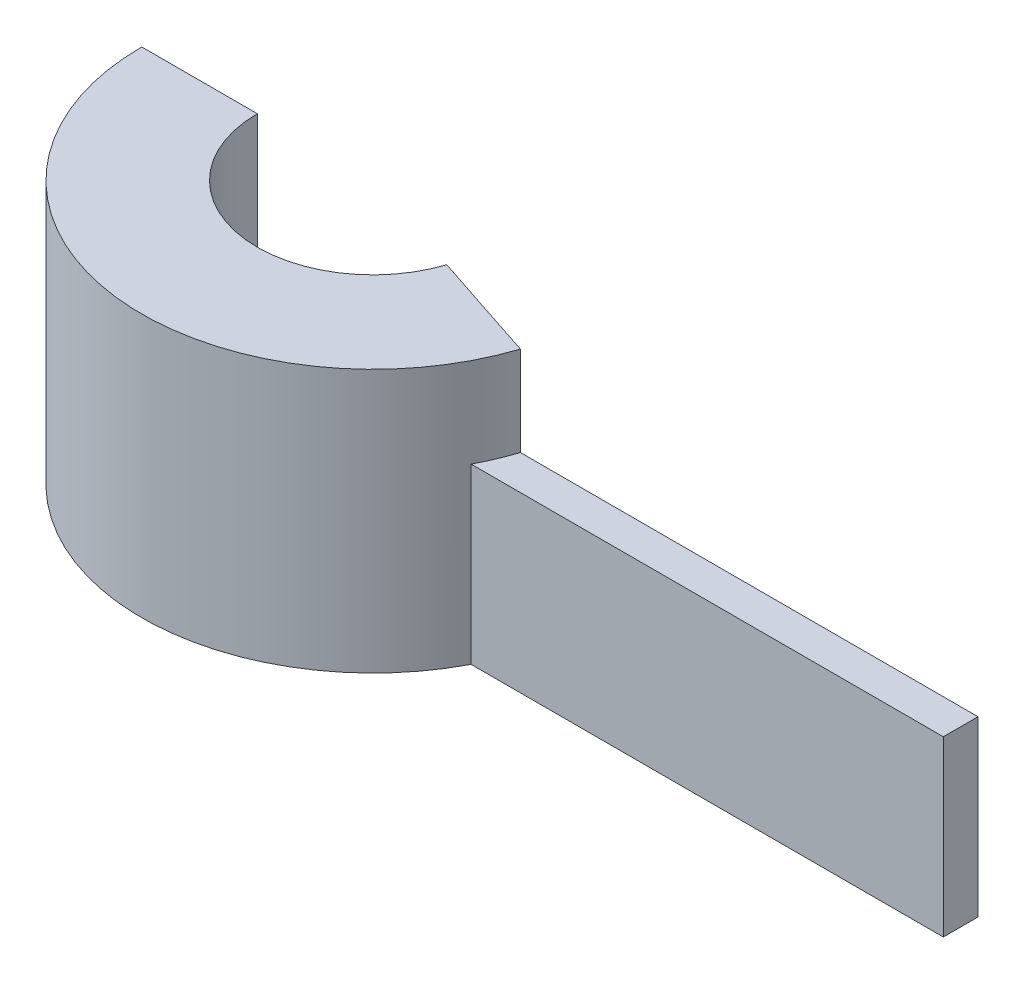
ISO-10303-21;
HEADER;
FILE_DESCRIPTION(('STEP AP214'),'2;1');
FILE_NAME('part.step','',(''),(''),'','','');
FILE_SCHEMA(('AUTOMOTIVE_DESIGN { 1 0 10303 214 1 1 1 1 }'));
ENDSEC;
DATA;
#1=APPLICATION_CONTEXT('core data for automotive mechanical design processes');
#2=APPLICATION_PROTOCOL_DEFINITION('international standard','automotive_design',2000,#1);
#3=PRODUCT_CONTEXT('',#1,'mechanical');
#4=PRODUCT('Part','Part','',(#3));
#5=PRODUCT_RELATED_PRODUCT_CATEGORY('part','',(#4));
#6=PRODUCT_DEFINITION_FORMATION('','',#4);
#7=PRODUCT_DEFINITION_CONTEXT('part definition',#1,'design');
#8=PRODUCT_DEFINITION('design','',#6,#7);
#9=PRODUCT_DEFINITION_SHAPE('','',#8);
#10=(LENGTH_UNIT() NAMED_UNIT(*) SI_UNIT(.MILLI.,.METRE.));
#11=(NAMED_UNIT(*) PLANE_ANGLE_UNIT() SI_UNIT($,.RADIAN.));
#12=(NAMED_UNIT(*) SI_UNIT($,.STERADIAN.) SOLID_ANGLE_UNIT());
#13=UNCERTAINTY_MEASURE_WITH_UNIT(LENGTH_MEASURE(1.E-05),#10,'distance_accuracy_value','');
#14=(GEOMETRIC_REPRESENTATION_CONTEXT(3) GLOBAL_UNCERTAINTY_ASSIGNED_CONTEXT((#13)) GLOBAL_UNIT_ASSIGNED_CONTEXT((#10,
#11,#12)) REPRESENTATION_CONTEXT('',''));
#15=CARTESIAN_POINT('',(0.,0.,0.));
#16=DIRECTION('',(0.,0.,1.));
#17=DIRECTION('',(1.,0.,0.));
#18=AXIS2_PLACEMENT_3D('',#15,#16,#17);
#19=CARTESIAN_POINT('',(0.,2.5,0.));
#20=DIRECTION('',(0.,1.,0.));
#21=DIRECTION('',(-1.,0.,0.));
#22=AXIS2_PLACEMENT_3D('',#19,#20,#21);
#23=CYLINDRICAL_SURFACE('',#22,20.);
#24=DIRECTION('',(0.,-1.,0.));
#25=VECTOR('',#24,1.);
#26=CARTESIAN_POINT('',(18.9983551919633,0.,6.25));
#27=LINE('',#26,#25);
#28=CARTESIAN_POINT('',(18.9983551919633,16.75,6.25));
#29=VERTEX_POINT('',#28);
#30=CARTESIAN_POINT('',(18.9983551919633,9.,6.25));
#31=VERTEX_POINT('',#30);
#32=EDGE_CURVE('E112',#29,#31,#27,.T.);
#33=ORIENTED_EDGE('',*,*,#32,.F.);
#34=CARTESIAN_POINT('',(0.,16.75,0.));
#35=DIRECTION('',(0.,1.,0.));
#36=DIRECTION('',(-1.,0.,0.));
#37=AXIS2_PLACEMENT_3D('',#34,#35,#36);
#38=CIRCLE('',#37,20.);
#39=CARTESIAN_POINT('',(-20.,16.75,-1.39659253553725E-13));
#40=VERTEX_POINT('',#39);
#41=EDGE_CURVE('E163',#40,#29,#38,.T.);
#42=ORIENTED_EDGE('',*,*,#41,.F.);
#43=DIRECTION('',(0.,-1.,0.));
#44=VECTOR('',#43,1.);
#45=CARTESIAN_POINT('',(-20.,0.,-1.39659253553725E-13));
#46=LINE('',#45,#44);
#47=CARTESIAN_POINT('',(-20.,-6.00000000000001,-1.39659253553725E-13));
#48=VERTEX_POINT('',#47);
#49=EDGE_CURVE('E146',#40,#48,#46,.T.);
#50=ORIENTED_EDGE('',*,*,#49,.T.);
#51=CARTESIAN_POINT('',(0.,-6.00000000000001,0.));
#52=DIRECTION('',(0.,1.,0.));
#53=DIRECTION('',(-1.,0.,0.));
#54=AXIS2_PLACEMENT_3D('',#51,#52,#53);
#55=CIRCLE('',#54,20.);
#56=CARTESIAN_POINT('',(17.7323856263053,-6.00000000000001,9.25));
#57=VERTEX_POINT('',#56);
#58=EDGE_CURVE('E59',#48,#57,#55,.T.);
#59=ORIENTED_EDGE('',*,*,#58,.T.);
#60=DIRECTION('',(0.,1.,0.));
#61=VECTOR('',#60,1.);
#62=CARTESIAN_POINT('',(17.7323856263053,2.5,9.25));
#63=LINE('',#62,#61);
#64=CARTESIAN_POINT('',(17.7323856263053,9.,9.25));
#65=VERTEX_POINT('',#64);
#66=EDGE_CURVE('E12',#57,#65,#63,.T.);
#67=ORIENTED_EDGE('',*,*,#66,.T.);
#68=CARTESIAN_POINT('',(0.,9.,0.));
#69=DIRECTION('',(0.,-1.,0.));
#70=DIRECTION('',(0.,0.,-1.));
#71=AXIS2_PLACEMENT_3D('',#68,#69,#70);
#72=CIRCLE('',#71,20.);
#73=EDGE_CURVE('E49',#65,#31,#72,.F.);
#74=ORIENTED_EDGE('',*,*,#73,.T.);
#75=EDGE_LOOP('',(#33,#42,#50,#59,#67,#74));
#76=FACE_BOUND('',#75,.T.);
#77=ADVANCED_FACE('F42',(#76),#23,.T.);
#78=CARTESIAN_POINT('',(0.,-6.00000000000001,0.));
#79=DIRECTION('',(0.,1.,0.));
#80=DIRECTION('',(-1.,0.,0.));
#81=AXIS2_PLACEMENT_3D('',#78,#79,#80);
#82=PLANE('',#81);
#83=DIRECTION('',(-1.,0.,0.));
#84=VECTOR('',#83,1.);
#85=CARTESIAN_POINT('',(0.,-6.00000000000001,0.));
#86=LINE('',#85,#84);
#87=CARTESIAN_POINT('',(0.,-6.00000000000001,0.));
#88=VERTEX_POINT('',#87);
#89=EDGE_CURVE('E123',#88,#48,#86,.T.);
#90=ORIENTED_EDGE('',*,*,#89,.F.);
#91=DIRECTION('',(0.949917759598166,0.,0.3125));
#92=VECTOR('',#91,1.);
#93=CARTESIAN_POINT('',(0.,-6.00000000000001,0.));
#94=LINE('',#93,#92);
#95=CARTESIAN_POINT('',(18.9983551919633,-6.00000000000001,6.25));
#96=VERTEX_POINT('',#95);
#97=EDGE_CURVE('E109',#88,#96,#94,.T.);
#98=ORIENTED_EDGE('',*,*,#97,.T.);
#99=DIRECTION('',(-1.,0.,0.));
#100=VECTOR('',#99,1.);
#101=CARTESIAN_POINT('',(0.,-6.00000000000001,6.25));
#102=LINE('',#101,#100);
#103=CARTESIAN_POINT('',(58.5667702402718,-6.00000000000001,6.25));
#104=VERTEX_POINT('',#103);
#105=EDGE_CURVE('E122',#104,#96,#102,.T.);
#106=ORIENTED_EDGE('',*,*,#105,.F.);
#107=DIRECTION('',(0.,0.,-1.));
#108=VECTOR('',#107,1.);
#109=CARTESIAN_POINT('',(58.5667702402718,-6.00000000000001,9.25));
#110=LINE('',#109,#108);
#111=CARTESIAN_POINT('',(58.5667702402718,-6.00000000000001,9.25));
#112=VERTEX_POINT('',#111);
#113=EDGE_CURVE('E140',#112,#104,#110,.T.);
#114=ORIENTED_EDGE('',*,*,#113,.F.);
#115=DIRECTION('',(-1.,0.,0.));
#116=VECTOR('',#115,1.);
#117=CARTESIAN_POINT('',(0.,-6.00000000000001,9.25));
#118=LINE('',#117,#116);
#119=EDGE_CURVE('E139',#112,#57,#118,.T.);
#120=ORIENTED_EDGE('',*,*,#119,.T.);
#121=ORIENTED_EDGE('',*,*,#58,.F.);
#122=EDGE_LOOP('',(#90,#98,#106,#114,#120,#121));
#123=FACE_BOUND('',#122,.T.);
#124=ADVANCED_FACE('F121',(#123),#82,.F.);
#125=CARTESIAN_POINT('',(0.,16.75,0.));
#126=DIRECTION('',(0.,-1.,0.));
#127=DIRECTION('',(1.,0.,0.));
#128=AXIS2_PLACEMENT_3D('',#125,#126,#127);
#129=PLANE('',#128);
#130=ORIENTED_EDGE('',*,*,#41,.T.);
#131=DIRECTION('',(-0.949917759598166,0.,-0.3125));
#132=VECTOR('',#131,1.);
#133=CARTESIAN_POINT('',(0.,16.75,0.));
#134=LINE('',#133,#132);
#135=CARTESIAN_POINT('',(9.49917759598166,16.75,3.125));
#136=VERTEX_POINT('',#135);
#137=EDGE_CURVE('E184',#29,#136,#134,.T.);
#138=ORIENTED_EDGE('',*,*,#137,.T.);
#139=CARTESIAN_POINT('',(0.,16.75,0.));
#140=DIRECTION('',(0.,1.,0.));
#141=DIRECTION('',(-1.,0.,0.));
#142=AXIS2_PLACEMENT_3D('',#139,#140,#141);
#143=CIRCLE('',#142,10.);
#144=CARTESIAN_POINT('',(-10.,16.75,0.));
#145=VERTEX_POINT('',#144);
#146=EDGE_CURVE('E160',#145,#136,#143,.T.);
#147=ORIENTED_EDGE('',*,*,#146,.F.);
#148=DIRECTION('',(1.,0.,0.));
#149=VECTOR('',#148,1.);
#150=CARTESIAN_POINT('',(0.,16.75,0.));
#151=LINE('',#150,#149);
#152=EDGE_CURVE('E148',#40,#145,#151,.T.);
#153=ORIENTED_EDGE('',*,*,#152,.F.);
#154=EDGE_LOOP('',(#130,#138,#147,#153));
#155=FACE_BOUND('',#154,.T.);
#156=ADVANCED_FACE('F188',(#155),#129,.F.);
#157=CARTESIAN_POINT('',(0.,2.5,0.));
#158=DIRECTION('',(0.,1.,0.));
#159=DIRECTION('',(-1.,0.,0.));
#160=AXIS2_PLACEMENT_3D('',#157,#158,#159);
#161=CYLINDRICAL_SURFACE('',#160,10.);
#162=ORIENTED_EDGE('',*,*,#146,.T.);
#163=DIRECTION('',(0.,-1.,0.));
#164=VECTOR('',#163,1.);
#165=CARTESIAN_POINT('',(9.49917759598166,0.,3.125));
#166=LINE('',#165,#164);
#167=CARTESIAN_POINT('',(9.49917759598166,2.5,3.125));
#168=VERTEX_POINT('',#167);
#169=EDGE_CURVE('E181',#136,#168,#166,.T.);
#170=ORIENTED_EDGE('',*,*,#169,.T.);
#171=CARTESIAN_POINT('',(0.,2.5,0.));
#172=DIRECTION('',(0.,1.,0.));
#173=DIRECTION('',(-1.,0.,0.));
#174=AXIS2_PLACEMENT_3D('',#171,#172,#173);
#175=CIRCLE('',#174,10.);
#176=CARTESIAN_POINT('',(-10.,2.5,0.));
#177=VERTEX_POINT('',#176);
#178=EDGE_CURVE('E157',#177,#168,#175,.T.);
#179=ORIENTED_EDGE('',*,*,#178,.F.);
#180=DIRECTION('',(0.,-1.,0.));
#181=VECTOR('',#180,1.);
#182=CARTESIAN_POINT('',(-10.,0.,0.));
#183=LINE('',#182,#181);
#184=EDGE_CURVE('E151',#145,#177,#183,.T.);
#185=ORIENTED_EDGE('',*,*,#184,.F.);
#186=EDGE_LOOP('',(#162,#170,#179,#185));
#187=FACE_BOUND('',#186,.T.);
#188=ADVANCED_FACE('F192',(#187),#161,.F.);
#189=CARTESIAN_POINT('',(0.,2.5,0.));
#190=DIRECTION('',(0.,-1.,0.));
#191=DIRECTION('',(1.,0.,0.));
#192=AXIS2_PLACEMENT_3D('',#189,#190,#191);
#193=PLANE('',#192);
#194=ORIENTED_EDGE('',*,*,#178,.T.);
#195=DIRECTION('',(-0.949917759598166,0.,-0.3125));
#196=VECTOR('',#195,1.);
#197=CARTESIAN_POINT('',(0.,2.5,0.));
#198=LINE('',#197,#196);
#199=CARTESIAN_POINT('',(0.,2.5,0.));
#200=VERTEX_POINT('',#199);
#201=EDGE_CURVE('E132',#168,#200,#198,.T.);
#202=ORIENTED_EDGE('',*,*,#201,.T.);
#203=DIRECTION('',(1.,0.,0.));
#204=VECTOR('',#203,1.);
#205=CARTESIAN_POINT('',(0.,2.5,0.));
#206=LINE('',#205,#204);
#207=EDGE_CURVE('E154',#177,#200,#206,.T.);
#208=ORIENTED_EDGE('',*,*,#207,.F.);
#209=EDGE_LOOP('',(#194,#202,#208));
#210=FACE_BOUND('',#209,.T.);
#211=ADVANCED_FACE('F198',(#210),#193,.F.);
#212=CARTESIAN_POINT('',(0.,0.,0.));
#213=DIRECTION('',(0.,0.,-1.));
#214=DIRECTION('',(-1.,0.,0.));
#215=AXIS2_PLACEMENT_3D('',#212,#213,#214);
#216=PLANE('',#215);
#217=DIRECTION('',(0.,-1.,0.));
#218=VECTOR('',#217,1.);
#219=CARTESIAN_POINT('',(0.,0.,0.));
#220=LINE('',#219,#218);
#221=EDGE_CURVE('E129',#200,#88,#220,.T.);
#222=ORIENTED_EDGE('',*,*,#221,.T.);
#223=ORIENTED_EDGE('',*,*,#89,.T.);
#224=ORIENTED_EDGE('',*,*,#49,.F.);
#225=ORIENTED_EDGE('',*,*,#152,.T.);
#226=ORIENTED_EDGE('',*,*,#184,.T.);
#227=ORIENTED_EDGE('',*,*,#207,.T.);
#228=EDGE_LOOP('',(#222,#223,#224,#225,#226,#227));
#229=FACE_BOUND('',#228,.T.);
#230=ADVANCED_FACE('F195',(#229),#216,.T.);
#231=CARTESIAN_POINT('',(58.5667702402718,0.,9.25));
#232=DIRECTION('',(-1.,0.,0.));
#233=DIRECTION('',(0.,0.,1.));
#234=AXIS2_PLACEMENT_3D('',#231,#232,#233);
#235=PLANE('',#234);
#236=DIRECTION('',(0.,1.,0.));
#237=VECTOR('',#236,1.);
#238=CARTESIAN_POINT('',(58.5667702402718,0.,6.25));
#239=LINE('',#238,#237);
#240=CARTESIAN_POINT('',(58.5667702402718,9.,6.25));
#241=VERTEX_POINT('',#240);
#242=EDGE_CURVE('E127',#104,#241,#239,.T.);
#243=ORIENTED_EDGE('',*,*,#242,.T.);
#244=DIRECTION('',(0.,0.,-1.));
#245=VECTOR('',#244,1.);
#246=CARTESIAN_POINT('',(58.5667702402718,9.,9.25));
#247=LINE('',#246,#245);
#248=CARTESIAN_POINT('',(58.5667702402718,9.,9.25));
#249=VERTEX_POINT('',#248);
#250=EDGE_CURVE('E142',#249,#241,#247,.T.);
#251=ORIENTED_EDGE('',*,*,#250,.F.);
#252=DIRECTION('',(0.,1.,0.));
#253=VECTOR('',#252,1.);
#254=CARTESIAN_POINT('',(58.5667702402718,0.,9.25));
#255=LINE('',#254,#253);
#256=EDGE_CURVE('E135',#112,#249,#255,.T.);
#257=ORIENTED_EDGE('',*,*,#256,.F.);
#258=ORIENTED_EDGE('',*,*,#113,.T.);
#259=EDGE_LOOP('',(#243,#251,#257,#258));
#260=FACE_BOUND('',#259,.T.);
#261=ADVANCED_FACE('F200',(#260),#235,.F.);
#262=CARTESIAN_POINT('',(0.,9.,9.25));
#263=DIRECTION('',(0.,-1.,0.));
#264=DIRECTION('',(0.,0.,-1.));
#265=AXIS2_PLACEMENT_3D('',#262,#263,#264);
#266=PLANE('',#265);
#267=ORIENTED_EDGE('',*,*,#73,.F.);
#268=DIRECTION('',(-1.,0.,0.));
#269=VECTOR('',#268,1.);
#270=CARTESIAN_POINT('',(0.,9.,9.25));
#271=LINE('',#270,#269);
#272=EDGE_CURVE('E170',#249,#65,#271,.T.);
#273=ORIENTED_EDGE('',*,*,#272,.F.);
#274=ORIENTED_EDGE('',*,*,#250,.T.);
#275=DIRECTION('',(-1.,0.,0.));
#276=VECTOR('',#275,1.);
#277=CARTESIAN_POINT('',(0.,9.,6.25));
#278=LINE('',#277,#276);
#279=EDGE_CURVE('E128',#241,#31,#278,.T.);
#280=ORIENTED_EDGE('',*,*,#279,.T.);
#281=EDGE_LOOP('',(#267,#273,#274,#280));
#282=FACE_BOUND('',#281,.T.);
#283=ADVANCED_FACE('F169',(#282),#266,.F.);
#284=CARTESIAN_POINT('',(0.,0.,9.25));
#285=DIRECTION('',(0.,0.,-1.));
#286=DIRECTION('',(-1.,0.,0.));
#287=AXIS2_PLACEMENT_3D('',#284,#285,#286);
#288=PLANE('',#287);
#289=ORIENTED_EDGE('',*,*,#66,.F.);
#290=ORIENTED_EDGE('',*,*,#119,.F.);
#291=ORIENTED_EDGE('',*,*,#256,.T.);
#292=ORIENTED_EDGE('',*,*,#272,.T.);
#293=EDGE_LOOP('',(#289,#290,#291,#292));
#294=FACE_BOUND('',#293,.T.);
#295=ADVANCED_FACE('F172',(#294),#288,.F.);
#296=CARTESIAN_POINT('',(0.,0.,6.25));
#297=DIRECTION('',(0.,0.,-1.));
#298=DIRECTION('',(-1.,0.,0.));
#299=AXIS2_PLACEMENT_3D('',#296,#297,#298);
#300=PLANE('',#299);
#301=ORIENTED_EDGE('',*,*,#105,.T.);
#302=DIRECTION('',(0.,1.,0.));
#303=VECTOR('',#302,1.);
#304=CARTESIAN_POINT('',(18.9983551919633,2.5,6.25));
#305=LINE('',#304,#303);
#306=EDGE_CURVE('E106',#96,#31,#305,.T.);
#307=ORIENTED_EDGE('',*,*,#306,.T.);
#308=ORIENTED_EDGE('',*,*,#279,.F.);
#309=ORIENTED_EDGE('',*,*,#242,.F.);
#310=EDGE_LOOP('',(#301,#307,#308,#309));
#311=FACE_BOUND('',#310,.T.);
#312=ADVANCED_FACE('F126',(#311),#300,.T.);
#313=CARTESIAN_POINT('',(0.,0.,0.));
#314=DIRECTION('',(-0.3125,0.,0.949917759598166));
#315=DIRECTION('',(0.949917759598166,0.,0.3125));
#316=AXIS2_PLACEMENT_3D('',#313,#314,#315);
#317=PLANE('',#316);
#318=ORIENTED_EDGE('',*,*,#97,.F.);
#319=ORIENTED_EDGE('',*,*,#221,.F.);
#320=ORIENTED_EDGE('',*,*,#201,.F.);
#321=ORIENTED_EDGE('',*,*,#169,.F.);
#322=ORIENTED_EDGE('',*,*,#137,.F.);
#323=ORIENTED_EDGE('',*,*,#32,.T.);
#324=ORIENTED_EDGE('',*,*,#306,.F.);
#325=EDGE_LOOP('',(#318,#319,#320,#321,#322,#323,#324));
#326=FACE_BOUND('',#325,.T.);
#327=ADVANCED_FACE('F108',(#326),#317,.F.);
#328=CLOSED_SHELL('',(#77,#124,#156,#188,#211,#230,#261,#283,#295,#312,#327));
#329=MANIFOLD_SOLID_BREP('B2',#328);
#330=ADVANCED_BREP_SHAPE_REPRESENTATION('',(#18,#329),#14);
#331=SHAPE_DEFINITION_REPRESENTATION(#9,#330);
ENDSEC;
END-ISO-10303-21;
